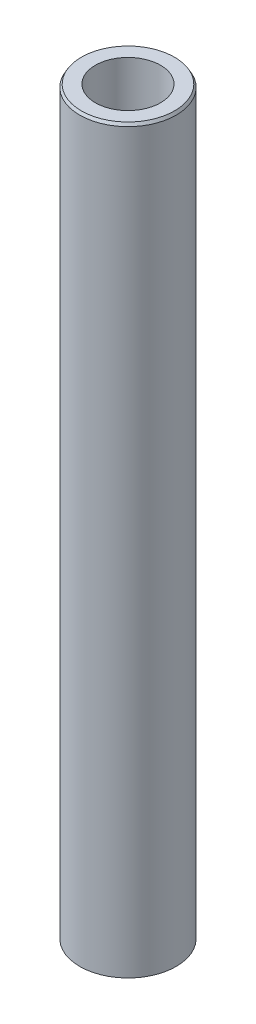
ISO-10303-21;
HEADER;
FILE_DESCRIPTION(('STEP AP214'),'2;1');
FILE_NAME('part.step','',(''),(''),'','','');
FILE_SCHEMA(('AUTOMOTIVE_DESIGN { 1 0 10303 214 1 1 1 1 }'));
ENDSEC;
DATA;
#1=APPLICATION_CONTEXT('core data for automotive mechanical design processes');
#2=APPLICATION_PROTOCOL_DEFINITION('international standard','automotive_design',2000,#1);
#3=PRODUCT_CONTEXT('',#1,'mechanical');
#4=PRODUCT('Part','Part','',(#3));
#5=PRODUCT_RELATED_PRODUCT_CATEGORY('part','',(#4));
#6=PRODUCT_DEFINITION_FORMATION('','',#4);
#7=PRODUCT_DEFINITION_CONTEXT('part definition',#1,'design');
#8=PRODUCT_DEFINITION('design','',#6,#7);
#9=PRODUCT_DEFINITION_SHAPE('','',#8);
#10=(LENGTH_UNIT() NAMED_UNIT(*) SI_UNIT(.MILLI.,.METRE.));
#11=(NAMED_UNIT(*) PLANE_ANGLE_UNIT() SI_UNIT($,.RADIAN.));
#12=(NAMED_UNIT(*) SI_UNIT($,.STERADIAN.) SOLID_ANGLE_UNIT());
#13=UNCERTAINTY_MEASURE_WITH_UNIT(LENGTH_MEASURE(1.E-05),#10,'distance_accuracy_value','');
#14=(GEOMETRIC_REPRESENTATION_CONTEXT(3) GLOBAL_UNCERTAINTY_ASSIGNED_CONTEXT((#13)) GLOBAL_UNIT_ASSIGNED_CONTEXT((#10,
#11,#12)) REPRESENTATION_CONTEXT('',''));
#15=CARTESIAN_POINT('',(0.,0.,0.));
#16=DIRECTION('',(0.,0.,1.));
#17=DIRECTION('',(1.,0.,0.));
#18=AXIS2_PLACEMENT_3D('',#15,#16,#17);
#19=CARTESIAN_POINT('',(0.,500.056925505551,0.));
#20=DIRECTION('',(0.,-1.,0.));
#21=DIRECTION('',(0.,0.,-1.));
#22=AXIS2_PLACEMENT_3D('',#19,#20,#21);
#23=CYLINDRICAL_SURFACE('',#22,32.5);
#24=CARTESIAN_POINT('',(0.,498.131722886503,0.));
#25=DIRECTION('',(0.,1.,0.));
#26=DIRECTION('',(0.,0.,1.));
#27=AXIS2_PLACEMENT_3D('',#24,#25,#26);
#28=CIRCLE('',#27,32.5);
#29=CARTESIAN_POINT('',(0.,498.131722886503,32.5));
#30=VERTEX_POINT('',#29);
#31=EDGE_CURVE('E50',#30,#30,#28,.F.);
#32=ORIENTED_EDGE('',*,*,#31,.T.);
#33=EDGE_LOOP('',(#32));
#34=FACE_BOUND('',#33,.T.);
#35=CARTESIAN_POINT('',(0.,1.11151625035211,0.));
#36=DIRECTION('',(0.,1.,0.));
#37=DIRECTION('',(0.,0.,1.));
#38=AXIS2_PLACEMENT_3D('',#35,#36,#37);
#39=CIRCLE('',#38,32.5);
#40=CARTESIAN_POINT('',(0.,1.11151625035211,32.5));
#41=VERTEX_POINT('',#40);
#42=EDGE_CURVE('E51',#41,#41,#39,.T.);
#43=ORIENTED_EDGE('',*,*,#42,.T.);
#44=EDGE_LOOP('',(#43));
#45=FACE_BOUND('',#44,.T.);
#46=ADVANCED_FACE('F39',(#34,#45),#23,.T.);
#47=CARTESIAN_POINT('',(0.,500.056925505551,0.));
#48=DIRECTION('',(0.,1.,0.));
#49=DIRECTION('',(0.,0.,1.));
#50=AXIS2_PLACEMENT_3D('',#47,#48,#49);
#51=PLANE('',#50);
#52=CARTESIAN_POINT('',(0.,500.056925505551,0.));
#53=DIRECTION('',(0.,1.,0.));
#54=DIRECTION('',(0.,0.,1.));
#55=AXIS2_PLACEMENT_3D('',#52,#53,#54);
#56=CIRCLE('',#55,31.3884837496478);
#57=CARTESIAN_POINT('',(0.,500.056925505551,31.3884837496478));
#58=VERTEX_POINT('',#57);
#59=EDGE_CURVE('E54',#58,#58,#56,.T.);
#60=ORIENTED_EDGE('',*,*,#59,.T.);
#61=EDGE_LOOP('',(#60));
#62=FACE_BOUND('',#61,.T.);
#63=CARTESIAN_POINT('',(0.,500.056925505551,0.));
#64=DIRECTION('',(0.,1.,0.));
#65=DIRECTION('',(0.,0.,1.));
#66=AXIS2_PLACEMENT_3D('',#63,#64,#65);
#67=CIRCLE('',#66,21.9657926769577);
#68=CARTESIAN_POINT('',(0.,500.056925505551,21.9657926769577));
#69=VERTEX_POINT('',#68);
#70=EDGE_CURVE('E58',#69,#69,#67,.T.);
#71=ORIENTED_EDGE('',*,*,#70,.F.);
#72=EDGE_LOOP('',(#71));
#73=FACE_BOUND('',#72,.T.);
#74=ADVANCED_FACE('F69',(#62,#73),#51,.T.);
#75=CARTESIAN_POINT('',(0.,0.,0.));
#76=DIRECTION('',(0.,1.,0.));
#77=DIRECTION('',(0.,0.,1.));
#78=AXIS2_PLACEMENT_3D('',#75,#76,#77);
#79=PLANE('',#78);
#80=CARTESIAN_POINT('',(0.,0.,0.));
#81=DIRECTION('',(0.,1.,0.));
#82=DIRECTION('',(0.,0.,1.));
#83=AXIS2_PLACEMENT_3D('',#80,#81,#82);
#84=CIRCLE('',#83,30.5747973809516);
#85=CARTESIAN_POINT('',(0.,0.,30.5747973809516));
#86=VERTEX_POINT('',#85);
#87=EDGE_CURVE('E10',#86,#86,#84,.F.);
#88=ORIENTED_EDGE('',*,*,#87,.T.);
#89=EDGE_LOOP('',(#88));
#90=FACE_BOUND('',#89,.T.);
#91=CARTESIAN_POINT('',(0.,0.,0.));
#92=DIRECTION('',(0.,1.,0.));
#93=DIRECTION('',(0.,0.,1.));
#94=AXIS2_PLACEMENT_3D('',#91,#92,#93);
#95=CIRCLE('',#94,21.9657926769577);
#96=CARTESIAN_POINT('',(0.,0.,21.9657926769577));
#97=VERTEX_POINT('',#96);
#98=EDGE_CURVE('E63',#97,#97,#95,.T.);
#99=ORIENTED_EDGE('',*,*,#98,.T.);
#100=EDGE_LOOP('',(#99));
#101=FACE_BOUND('',#100,.T.);
#102=ADVANCED_FACE('F75',(#90,#101),#79,.F.);
#103=CARTESIAN_POINT('',(0.,500.056925505551,0.));
#104=DIRECTION('',(0.,-1.,0.));
#105=DIRECTION('',(0.,0.,-1.));
#106=AXIS2_PLACEMENT_3D('',#103,#104,#105);
#107=CYLINDRICAL_SURFACE('',#106,21.9657926769577);
#108=ORIENTED_EDGE('',*,*,#70,.T.);
#109=EDGE_LOOP('',(#108));
#110=FACE_BOUND('',#109,.T.);
#111=ORIENTED_EDGE('',*,*,#98,.F.);
#112=EDGE_LOOP('',(#111));
#113=FACE_BOUND('',#112,.T.);
#114=ADVANCED_FACE('F70',(#110,#113),#107,.F.);
#115=CARTESIAN_POINT('',(0.,500.056925505551,0.));
#116=DIRECTION('',(0.,-1.,0.));
#117=DIRECTION('',(0.,0.,-1.));
#118=AXIS2_PLACEMENT_3D('',#115,#116,#117);
#119=CONICAL_SURFACE('',#118,31.3884837496478,0.523598775598287);
#120=ORIENTED_EDGE('',*,*,#31,.F.);
#121=EDGE_LOOP('',(#120));
#122=FACE_BOUND('',#121,.T.);
#123=ORIENTED_EDGE('',*,*,#59,.F.);
#124=EDGE_LOOP('',(#123));
#125=FACE_BOUND('',#124,.T.);
#126=ADVANCED_FACE('F81',(#122,#125),#119,.T.);
#127=CARTESIAN_POINT('',(0.,1.11151625035211,0.));
#128=DIRECTION('',(0.,1.,0.));
#129=DIRECTION('',(0.,0.,1.));
#130=AXIS2_PLACEMENT_3D('',#127,#128,#129);
#131=CONICAL_SURFACE('',#130,32.5,1.04719755119661);
#132=ORIENTED_EDGE('',*,*,#87,.F.);
#133=EDGE_LOOP('',(#132));
#134=FACE_BOUND('',#133,.T.);
#135=ORIENTED_EDGE('',*,*,#42,.F.);
#136=EDGE_LOOP('',(#135));
#137=FACE_BOUND('',#136,.T.);
#138=ADVANCED_FACE('F45',(#134,#137),#131,.T.);
#139=CLOSED_SHELL('',(#46,#74,#102,#114,#126,#138));
#140=MANIFOLD_SOLID_BREP('B2',#139);
#141=ADVANCED_BREP_SHAPE_REPRESENTATION('',(#18,#140),#14);
#142=SHAPE_DEFINITION_REPRESENTATION(#9,#141);
ENDSEC;
END-ISO-10303-21;
